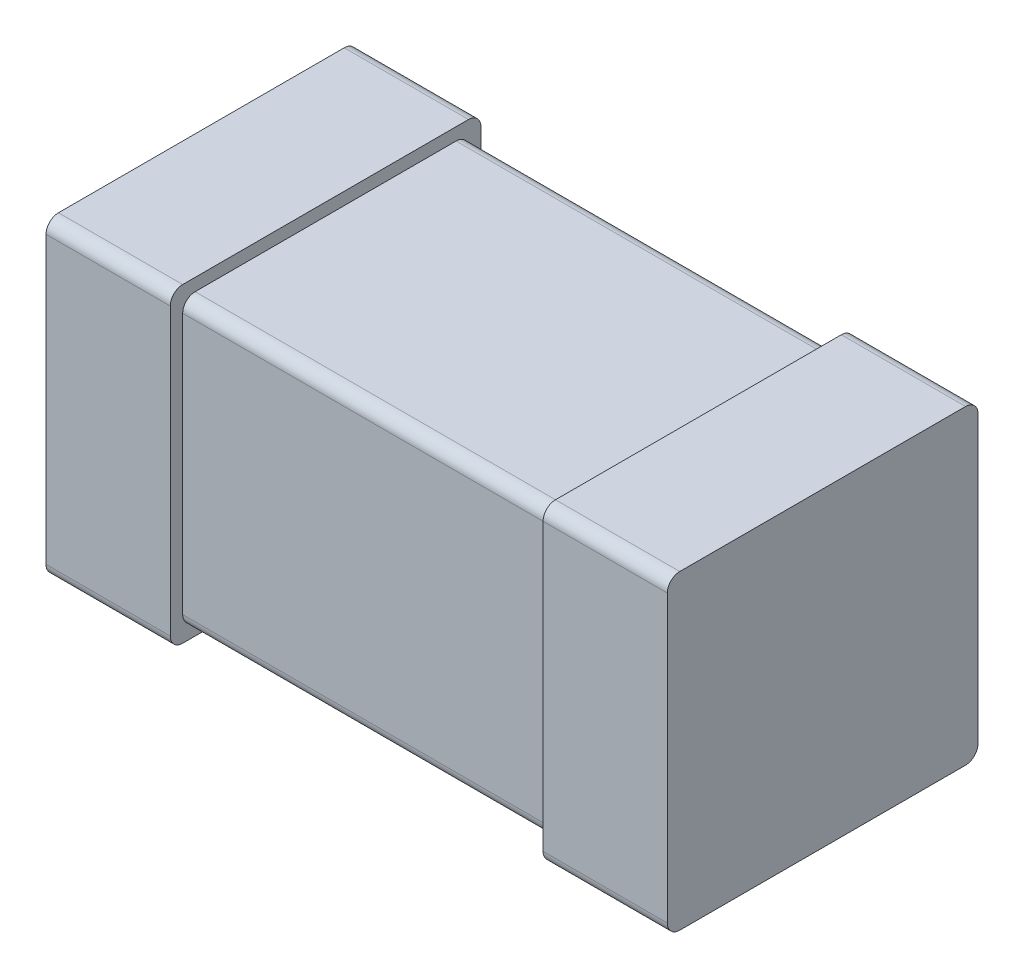
ISO-10303-21;
HEADER;
FILE_DESCRIPTION(('STEP AP214'),'2;1');
FILE_NAME('part.step','',(''),(''),'','','');
FILE_SCHEMA(('AUTOMOTIVE_DESIGN { 1 0 10303 214 1 1 1 1 }'));
ENDSEC;
DATA;
#1=APPLICATION_CONTEXT('core data for automotive mechanical design processes');
#2=APPLICATION_PROTOCOL_DEFINITION('international standard','automotive_design',2000,#1);
#3=PRODUCT_CONTEXT('',#1,'mechanical');
#4=PRODUCT('Part','Part','',(#3));
#5=PRODUCT_RELATED_PRODUCT_CATEGORY('part','',(#4));
#6=PRODUCT_DEFINITION_FORMATION('','',#4);
#7=PRODUCT_DEFINITION_CONTEXT('part definition',#1,'design');
#8=PRODUCT_DEFINITION('design','',#6,#7);
#9=PRODUCT_DEFINITION_SHAPE('','',#8);
#10=(LENGTH_UNIT() NAMED_UNIT(*) SI_UNIT(.MILLI.,.METRE.));
#11=(NAMED_UNIT(*) PLANE_ANGLE_UNIT() SI_UNIT($,.RADIAN.));
#12=(NAMED_UNIT(*) SI_UNIT($,.STERADIAN.) SOLID_ANGLE_UNIT());
#13=UNCERTAINTY_MEASURE_WITH_UNIT(LENGTH_MEASURE(1.E-05),#10,'distance_accuracy_value','');
#14=(GEOMETRIC_REPRESENTATION_CONTEXT(3) GLOBAL_UNCERTAINTY_ASSIGNED_CONTEXT((#13)) GLOBAL_UNIT_ASSIGNED_CONTEXT((#10,
#11,#12)) REPRESENTATION_CONTEXT('',''));
#15=CARTESIAN_POINT('',(0.,0.,0.));
#16=DIRECTION('',(0.,0.,1.));
#17=DIRECTION('',(1.,0.,0.));
#18=AXIS2_PLACEMENT_3D('',#15,#16,#17);
#19=CARTESIAN_POINT('',(0.5,-0.25,0.));
#20=DIRECTION('',(1.,0.,0.));
#21=DIRECTION('',(0.,1.,0.));
#22=AXIS2_PLACEMENT_3D('',#19,#20,#21);
#23=PLANE('',#22);
#24=DIRECTION('',(0.,0.,1.));
#25=VECTOR('',#24,1.);
#26=CARTESIAN_POINT('',(0.5,-0.25,0.));
#27=LINE('',#26,#25);
#28=CARTESIAN_POINT('',(0.5,-0.25,0.02));
#29=VERTEX_POINT('',#28);
#30=CARTESIAN_POINT('',(0.5,-0.25,0.48));
#31=VERTEX_POINT('',#30);
#32=EDGE_CURVE('E409',#29,#31,#27,.T.);
#33=ORIENTED_EDGE('',*,*,#32,.F.);
#34=CARTESIAN_POINT('',(0.5,-0.23,0.02));
#35=DIRECTION('',(1.,0.,0.));
#36=DIRECTION('',(0.,0.,1.));
#37=AXIS2_PLACEMENT_3D('',#34,#35,#36);
#38=CIRCLE('',#37,0.02);
#39=CARTESIAN_POINT('',(0.5,-0.23,0.));
#40=VERTEX_POINT('',#39);
#41=EDGE_CURVE('E286',#29,#40,#38,.T.);
#42=ORIENTED_EDGE('',*,*,#41,.T.);
#43=DIRECTION('',(0.,1.,0.));
#44=VECTOR('',#43,1.);
#45=CARTESIAN_POINT('',(0.5,-0.25,0.));
#46=LINE('',#45,#44);
#47=CARTESIAN_POINT('',(0.5,0.23,0.));
#48=VERTEX_POINT('',#47);
#49=EDGE_CURVE('E301',#40,#48,#46,.T.);
#50=ORIENTED_EDGE('',*,*,#49,.T.);
#51=CARTESIAN_POINT('',(0.5,0.23,0.02));
#52=DIRECTION('',(-1.,0.,0.));
#53=DIRECTION('',(0.,0.,1.));
#54=AXIS2_PLACEMENT_3D('',#51,#52,#53);
#55=CIRCLE('',#54,0.02);
#56=CARTESIAN_POINT('',(0.5,0.25,0.02));
#57=VERTEX_POINT('',#56);
#58=EDGE_CURVE('E423',#57,#48,#55,.T.);
#59=ORIENTED_EDGE('',*,*,#58,.F.);
#60=DIRECTION('',(0.,0.,1.));
#61=VECTOR('',#60,1.);
#62=CARTESIAN_POINT('',(0.5,0.25,0.));
#63=LINE('',#62,#61);
#64=CARTESIAN_POINT('',(0.5,0.25,0.48));
#65=VERTEX_POINT('',#64);
#66=EDGE_CURVE('E11',#57,#65,#63,.T.);
#67=ORIENTED_EDGE('',*,*,#66,.T.);
#68=CARTESIAN_POINT('',(0.5,0.23,0.48));
#69=DIRECTION('',(1.,0.,0.));
#70=DIRECTION('',(0.,0.,1.));
#71=AXIS2_PLACEMENT_3D('',#68,#69,#70);
#72=CIRCLE('',#71,0.02);
#73=CARTESIAN_POINT('',(0.5,0.23,0.5));
#74=VERTEX_POINT('',#73);
#75=EDGE_CURVE('E21',#65,#74,#72,.T.);
#76=ORIENTED_EDGE('',*,*,#75,.T.);
#77=DIRECTION('',(0.,1.,0.));
#78=VECTOR('',#77,1.);
#79=CARTESIAN_POINT('',(0.5,-0.25,0.5));
#80=LINE('',#79,#78);
#81=CARTESIAN_POINT('',(0.5,-0.23,0.5));
#82=VERTEX_POINT('',#81);
#83=EDGE_CURVE('E332',#82,#74,#80,.T.);
#84=ORIENTED_EDGE('',*,*,#83,.F.);
#85=CARTESIAN_POINT('',(0.5,-0.23,0.48));
#86=DIRECTION('',(-1.,0.,0.));
#87=DIRECTION('',(0.,0.,1.));
#88=AXIS2_PLACEMENT_3D('',#85,#86,#87);
#89=CIRCLE('',#88,0.02);
#90=EDGE_CURVE('E281',#31,#82,#89,.T.);
#91=ORIENTED_EDGE('',*,*,#90,.F.);
#92=EDGE_LOOP('',(#33,#42,#50,#59,#67,#76,#84,#91));
#93=FACE_BOUND('',#92,.T.);
#94=ADVANCED_FACE('F18',(#93),#23,.T.);
#95=CARTESIAN_POINT('',(0.3,0.25,0.));
#96=DIRECTION('',(0.,1.,0.));
#97=DIRECTION('',(1.,0.,0.));
#98=AXIS2_PLACEMENT_3D('',#95,#96,#97);
#99=PLANE('',#98);
#100=ORIENTED_EDGE('',*,*,#66,.F.);
#101=DIRECTION('',(1.,0.,0.));
#102=VECTOR('',#101,1.);
#103=CARTESIAN_POINT('',(0.3,0.25,0.02));
#104=LINE('',#103,#102);
#105=CARTESIAN_POINT('',(0.3,0.25,0.02));
#106=VERTEX_POINT('',#105);
#107=EDGE_CURVE('E420',#106,#57,#104,.T.);
#108=ORIENTED_EDGE('',*,*,#107,.F.);
#109=DIRECTION('',(0.,0.,1.));
#110=VECTOR('',#109,1.);
#111=CARTESIAN_POINT('',(0.3,0.25,0.));
#112=LINE('',#111,#110);
#113=CARTESIAN_POINT('',(0.3,0.25,0.48));
#114=VERTEX_POINT('',#113);
#115=EDGE_CURVE('E381',#106,#114,#112,.T.);
#116=ORIENTED_EDGE('',*,*,#115,.T.);
#117=DIRECTION('',(1.,0.,0.));
#118=VECTOR('',#117,1.);
#119=CARTESIAN_POINT('',(0.3,0.25,0.48));
#120=LINE('',#119,#118);
#121=EDGE_CURVE('E27',#114,#65,#120,.T.);
#122=ORIENTED_EDGE('',*,*,#121,.T.);
#123=EDGE_LOOP('',(#100,#108,#116,#122));
#124=FACE_BOUND('',#123,.T.);
#125=ADVANCED_FACE('F604',(#124),#99,.T.);
#126=CARTESIAN_POINT('',(0.3,0.23,0.48));
#127=DIRECTION('',(1.,0.,0.));
#128=DIRECTION('',(0.,1.,0.));
#129=AXIS2_PLACEMENT_3D('',#126,#127,#128);
#130=CYLINDRICAL_SURFACE('',#129,0.02);
#131=CARTESIAN_POINT('',(0.3,0.23,0.48));
#132=DIRECTION('',(1.,0.,0.));
#133=DIRECTION('',(0.,0.,1.));
#134=AXIS2_PLACEMENT_3D('',#131,#132,#133);
#135=CIRCLE('',#134,0.02);
#136=CARTESIAN_POINT('',(0.3,0.23,0.5));
#137=VERTEX_POINT('',#136);
#138=EDGE_CURVE('E380',#114,#137,#135,.T.);
#139=ORIENTED_EDGE('',*,*,#138,.T.);
#140=DIRECTION('',(1.,0.,0.));
#141=VECTOR('',#140,1.);
#142=CARTESIAN_POINT('',(0.3,0.23,0.5));
#143=LINE('',#142,#141);
#144=EDGE_CURVE('E336',#137,#74,#143,.T.);
#145=ORIENTED_EDGE('',*,*,#144,.T.);
#146=ORIENTED_EDGE('',*,*,#75,.F.);
#147=ORIENTED_EDGE('',*,*,#121,.F.);
#148=EDGE_LOOP('',(#139,#145,#146,#147));
#149=FACE_BOUND('',#148,.T.);
#150=ADVANCED_FACE('F434',(#149),#130,.T.);
#151=CARTESIAN_POINT('',(0.3,0.23,0.02));
#152=DIRECTION('',(1.,0.,0.));
#153=DIRECTION('',(0.,1.,0.));
#154=AXIS2_PLACEMENT_3D('',#151,#152,#153);
#155=CYLINDRICAL_SURFACE('',#154,0.02);
#156=ORIENTED_EDGE('',*,*,#107,.T.);
#157=ORIENTED_EDGE('',*,*,#58,.T.);
#158=DIRECTION('',(1.,0.,0.));
#159=VECTOR('',#158,1.);
#160=CARTESIAN_POINT('',(0.3,0.23,0.));
#161=LINE('',#160,#159);
#162=CARTESIAN_POINT('',(0.3,0.23,0.));
#163=VERTEX_POINT('',#162);
#164=EDGE_CURVE('E297',#163,#48,#161,.T.);
#165=ORIENTED_EDGE('',*,*,#164,.F.);
#166=CARTESIAN_POINT('',(0.3,0.23,0.02));
#167=DIRECTION('',(-1.,0.,0.));
#168=DIRECTION('',(0.,0.,1.));
#169=AXIS2_PLACEMENT_3D('',#166,#167,#168);
#170=CIRCLE('',#169,0.02);
#171=EDGE_CURVE('E385',#106,#163,#170,.T.);
#172=ORIENTED_EDGE('',*,*,#171,.F.);
#173=EDGE_LOOP('',(#156,#157,#165,#172));
#174=FACE_BOUND('',#173,.T.);
#175=ADVANCED_FACE('F611',(#174),#155,.T.);
#176=CARTESIAN_POINT('',(0.3,-0.25,0.5));
#177=DIRECTION('',(0.,0.,1.));
#178=DIRECTION('',(1.,0.,0.));
#179=AXIS2_PLACEMENT_3D('',#176,#177,#178);
#180=PLANE('',#179);
#181=DIRECTION('',(0.,1.,0.));
#182=VECTOR('',#181,1.);
#183=CARTESIAN_POINT('',(0.3,-0.25,0.5));
#184=LINE('',#183,#182);
#185=CARTESIAN_POINT('',(0.3,-0.23,0.5));
#186=VERTEX_POINT('',#185);
#187=EDGE_CURVE('E270',#186,#137,#184,.T.);
#188=ORIENTED_EDGE('',*,*,#187,.F.);
#189=DIRECTION('',(1.,0.,0.));
#190=VECTOR('',#189,1.);
#191=CARTESIAN_POINT('',(0.3,-0.23,0.5));
#192=LINE('',#191,#190);
#193=EDGE_CURVE('E285',#186,#82,#192,.T.);
#194=ORIENTED_EDGE('',*,*,#193,.T.);
#195=ORIENTED_EDGE('',*,*,#83,.T.);
#196=ORIENTED_EDGE('',*,*,#144,.F.);
#197=EDGE_LOOP('',(#188,#194,#195,#196));
#198=FACE_BOUND('',#197,.T.);
#199=ADVANCED_FACE('F438',(#198),#180,.T.);
#200=CARTESIAN_POINT('',(0.3,-0.25,0.));
#201=DIRECTION('',(0.,0.,1.));
#202=DIRECTION('',(1.,0.,0.));
#203=AXIS2_PLACEMENT_3D('',#200,#201,#202);
#204=PLANE('',#203);
#205=ORIENTED_EDGE('',*,*,#164,.T.);
#206=ORIENTED_EDGE('',*,*,#49,.F.);
#207=DIRECTION('',(1.,0.,0.));
#208=VECTOR('',#207,1.);
#209=CARTESIAN_POINT('',(0.3,-0.23,0.));
#210=LINE('',#209,#208);
#211=CARTESIAN_POINT('',(0.3,-0.23,0.));
#212=VERTEX_POINT('',#211);
#213=EDGE_CURVE('E413',#212,#40,#210,.T.);
#214=ORIENTED_EDGE('',*,*,#213,.F.);
#215=DIRECTION('',(0.,1.,0.));
#216=VECTOR('',#215,1.);
#217=CARTESIAN_POINT('',(0.3,-0.25,0.));
#218=LINE('',#217,#216);
#219=EDGE_CURVE('E389',#212,#163,#218,.T.);
#220=ORIENTED_EDGE('',*,*,#219,.T.);
#221=EDGE_LOOP('',(#205,#206,#214,#220));
#222=FACE_BOUND('',#221,.T.);
#223=ADVANCED_FACE('F618',(#222),#204,.F.);
#224=CARTESIAN_POINT('',(0.3,-0.23,0.48));
#225=DIRECTION('',(1.,0.,0.));
#226=DIRECTION('',(0.,-1.,0.));
#227=AXIS2_PLACEMENT_3D('',#224,#225,#226);
#228=CYLINDRICAL_SURFACE('',#227,0.02);
#229=DIRECTION('',(1.,0.,0.));
#230=VECTOR('',#229,1.);
#231=CARTESIAN_POINT('',(0.3,-0.25,0.48));
#232=LINE('',#231,#230);
#233=CARTESIAN_POINT('',(0.3,-0.25,0.48));
#234=VERTEX_POINT('',#233);
#235=EDGE_CURVE('E401',#234,#31,#232,.T.);
#236=ORIENTED_EDGE('',*,*,#235,.T.);
#237=ORIENTED_EDGE('',*,*,#90,.T.);
#238=ORIENTED_EDGE('',*,*,#193,.F.);
#239=CARTESIAN_POINT('',(0.3,-0.23,0.48));
#240=DIRECTION('',(-1.,0.,0.));
#241=DIRECTION('',(0.,0.,1.));
#242=AXIS2_PLACEMENT_3D('',#239,#240,#241);
#243=CIRCLE('',#242,0.02);
#244=EDGE_CURVE('E268',#234,#186,#243,.T.);
#245=ORIENTED_EDGE('',*,*,#244,.F.);
#246=EDGE_LOOP('',(#236,#237,#238,#245));
#247=FACE_BOUND('',#246,.T.);
#248=ADVANCED_FACE('F441',(#247),#228,.T.);
#249=CARTESIAN_POINT('',(0.3,-0.23,0.02));
#250=DIRECTION('',(1.,0.,0.));
#251=DIRECTION('',(0.,-1.,0.));
#252=AXIS2_PLACEMENT_3D('',#249,#250,#251);
#253=CYLINDRICAL_SURFACE('',#252,0.02);
#254=CARTESIAN_POINT('',(0.3,-0.23,0.02));
#255=DIRECTION('',(1.,0.,0.));
#256=DIRECTION('',(0.,0.,1.));
#257=AXIS2_PLACEMENT_3D('',#254,#255,#256);
#258=CIRCLE('',#257,0.02);
#259=CARTESIAN_POINT('',(0.3,-0.25,0.02));
#260=VERTEX_POINT('',#259);
#261=EDGE_CURVE('E393',#260,#212,#258,.T.);
#262=ORIENTED_EDGE('',*,*,#261,.T.);
#263=ORIENTED_EDGE('',*,*,#213,.T.);
#264=ORIENTED_EDGE('',*,*,#41,.F.);
#265=DIRECTION('',(1.,0.,0.));
#266=VECTOR('',#265,1.);
#267=CARTESIAN_POINT('',(0.3,-0.25,0.02));
#268=LINE('',#267,#266);
#269=EDGE_CURVE('E405',#260,#29,#268,.T.);
#270=ORIENTED_EDGE('',*,*,#269,.F.);
#271=EDGE_LOOP('',(#262,#263,#264,#270));
#272=FACE_BOUND('',#271,.T.);
#273=ADVANCED_FACE('F448',(#272),#253,.T.);
#274=CARTESIAN_POINT('',(0.3,-0.25,0.));
#275=DIRECTION('',(0.,1.,0.));
#276=DIRECTION('',(1.,0.,0.));
#277=AXIS2_PLACEMENT_3D('',#274,#275,#276);
#278=PLANE('',#277);
#279=ORIENTED_EDGE('',*,*,#235,.F.);
#280=DIRECTION('',(0.,0.,1.));
#281=VECTOR('',#280,1.);
#282=CARTESIAN_POINT('',(0.3,-0.25,0.));
#283=LINE('',#282,#281);
#284=EDGE_CURVE('E397',#260,#234,#283,.T.);
#285=ORIENTED_EDGE('',*,*,#284,.F.);
#286=ORIENTED_EDGE('',*,*,#269,.T.);
#287=ORIENTED_EDGE('',*,*,#32,.T.);
#288=EDGE_LOOP('',(#279,#285,#286,#287));
#289=FACE_BOUND('',#288,.T.);
#290=ADVANCED_FACE('F444',(#289),#278,.F.);
#291=CARTESIAN_POINT('',(0.3,-0.25,0.));
#292=DIRECTION('',(1.,0.,0.));
#293=DIRECTION('',(0.,1.,0.));
#294=AXIS2_PLACEMENT_3D('',#291,#292,#293);
#295=PLANE('',#294);
#296=DIRECTION('',(0.,1.,0.));
#297=VECTOR('',#296,1.);
#298=CARTESIAN_POINT('',(0.3,-0.23,0.02));
#299=LINE('',#298,#297);
#300=CARTESIAN_POINT('',(0.3,-0.21,0.02));
#301=VERTEX_POINT('',#300);
#302=CARTESIAN_POINT('',(0.3,0.21,0.02));
#303=VERTEX_POINT('',#302);
#304=EDGE_CURVE('E341',#301,#303,#299,.T.);
#305=ORIENTED_EDGE('',*,*,#304,.T.);
#306=CARTESIAN_POINT('',(0.3,0.21,0.04));
#307=DIRECTION('',(-1.,0.,0.));
#308=DIRECTION('',(0.,0.,1.));
#309=AXIS2_PLACEMENT_3D('',#306,#307,#308);
#310=CIRCLE('',#309,0.02);
#311=CARTESIAN_POINT('',(0.3,0.23,0.04));
#312=VERTEX_POINT('',#311);
#313=EDGE_CURVE('E314',#312,#303,#310,.T.);
#314=ORIENTED_EDGE('',*,*,#313,.F.);
#315=DIRECTION('',(0.,0.,1.));
#316=VECTOR('',#315,1.);
#317=CARTESIAN_POINT('',(0.3,0.23,0.02));
#318=LINE('',#317,#316);
#319=CARTESIAN_POINT('',(0.3,0.23,0.46));
#320=VERTEX_POINT('',#319);
#321=EDGE_CURVE('E310',#312,#320,#318,.T.);
#322=ORIENTED_EDGE('',*,*,#321,.T.);
#323=CARTESIAN_POINT('',(0.3,0.21,0.46));
#324=DIRECTION('',(1.,0.,0.));
#325=DIRECTION('',(0.,0.,1.));
#326=AXIS2_PLACEMENT_3D('',#323,#324,#325);
#327=CIRCLE('',#326,0.02);
#328=CARTESIAN_POINT('',(0.3,0.21,0.48));
#329=VERTEX_POINT('',#328);
#330=EDGE_CURVE('E291',#320,#329,#327,.T.);
#331=ORIENTED_EDGE('',*,*,#330,.T.);
#332=DIRECTION('',(0.,1.,0.));
#333=VECTOR('',#332,1.);
#334=CARTESIAN_POINT('',(0.3,-0.23,0.48));
#335=LINE('',#334,#333);
#336=CARTESIAN_POINT('',(0.3,-0.21,0.48));
#337=VERTEX_POINT('',#336);
#338=EDGE_CURVE('E278',#337,#329,#335,.T.);
#339=ORIENTED_EDGE('',*,*,#338,.F.);
#340=CARTESIAN_POINT('',(0.3,-0.21,0.46));
#341=DIRECTION('',(-1.,0.,0.));
#342=DIRECTION('',(0.,0.,1.));
#343=AXIS2_PLACEMENT_3D('',#340,#341,#342);
#344=CIRCLE('',#343,0.02);
#345=CARTESIAN_POINT('',(0.3,-0.23,0.46));
#346=VERTEX_POINT('',#345);
#347=EDGE_CURVE('E277',#346,#337,#344,.T.);
#348=ORIENTED_EDGE('',*,*,#347,.F.);
#349=DIRECTION('',(0.,0.,1.));
#350=VECTOR('',#349,1.);
#351=CARTESIAN_POINT('',(0.3,-0.23,0.02));
#352=LINE('',#351,#350);
#353=CARTESIAN_POINT('',(0.3,-0.23,0.04));
#354=VERTEX_POINT('',#353);
#355=EDGE_CURVE('E271',#354,#346,#352,.T.);
#356=ORIENTED_EDGE('',*,*,#355,.F.);
#357=CARTESIAN_POINT('',(0.3,-0.21,0.04));
#358=DIRECTION('',(1.,0.,0.));
#359=DIRECTION('',(0.,0.,1.));
#360=AXIS2_PLACEMENT_3D('',#357,#358,#359);
#361=CIRCLE('',#360,0.02);
#362=EDGE_CURVE('E345',#354,#301,#361,.T.);
#363=ORIENTED_EDGE('',*,*,#362,.T.);
#364=EDGE_LOOP('',(#305,#314,#322,#331,#339,#348,#356,#363));
#365=FACE_BOUND('',#364,.T.);
#366=ORIENTED_EDGE('',*,*,#244,.T.);
#367=ORIENTED_EDGE('',*,*,#187,.T.);
#368=ORIENTED_EDGE('',*,*,#138,.F.);
#369=ORIENTED_EDGE('',*,*,#115,.F.);
#370=ORIENTED_EDGE('',*,*,#171,.T.);
#371=ORIENTED_EDGE('',*,*,#219,.F.);
#372=ORIENTED_EDGE('',*,*,#261,.F.);
#373=ORIENTED_EDGE('',*,*,#284,.T.);
#374=EDGE_LOOP('',(#366,#367,#368,#369,#370,#371,#372,#373));
#375=FACE_BOUND('',#374,.T.);
#376=ADVANCED_FACE('F505',(#365,#375),#295,.F.);
#377=CARTESIAN_POINT('',(-0.3,-0.23,0.02));
#378=DIRECTION('',(0.,1.,0.));
#379=DIRECTION('',(1.,0.,0.));
#380=AXIS2_PLACEMENT_3D('',#377,#378,#379);
#381=PLANE('',#380);
#382=DIRECTION('',(1.,0.,0.));
#383=VECTOR('',#382,1.);
#384=CARTESIAN_POINT('',(-0.3,-0.23,0.46));
#385=LINE('',#384,#383);
#386=CARTESIAN_POINT('',(-0.3,-0.23,0.46));
#387=VERTEX_POINT('',#386);
#388=EDGE_CURVE('E273',#387,#346,#385,.T.);
#389=ORIENTED_EDGE('',*,*,#388,.F.);
#390=DIRECTION('',(0.,0.,1.));
#391=VECTOR('',#390,1.);
#392=CARTESIAN_POINT('',(-0.3,-0.23,0.02));
#393=LINE('',#392,#391);
#394=CARTESIAN_POINT('',(-0.3,-0.23,0.04));
#395=VERTEX_POINT('',#394);
#396=EDGE_CURVE('E296',#395,#387,#393,.T.);
#397=ORIENTED_EDGE('',*,*,#396,.F.);
#398=DIRECTION('',(1.,0.,0.));
#399=VECTOR('',#398,1.);
#400=CARTESIAN_POINT('',(-0.3,-0.23,0.04));
#401=LINE('',#400,#399);
#402=EDGE_CURVE('E346',#395,#354,#401,.T.);
#403=ORIENTED_EDGE('',*,*,#402,.T.);
#404=ORIENTED_EDGE('',*,*,#355,.T.);
#405=EDGE_LOOP('',(#389,#397,#403,#404));
#406=FACE_BOUND('',#405,.T.);
#407=ADVANCED_FACE('F522',(#406),#381,.F.);
#408=CARTESIAN_POINT('',(-0.3,-0.21,0.46));
#409=DIRECTION('',(1.,0.,0.));
#410=DIRECTION('',(0.,-1.,0.));
#411=AXIS2_PLACEMENT_3D('',#408,#409,#410);
#412=CYLINDRICAL_SURFACE('',#411,0.02);
#413=ORIENTED_EDGE('',*,*,#388,.T.);
#414=ORIENTED_EDGE('',*,*,#347,.T.);
#415=DIRECTION('',(1.,0.,0.));
#416=VECTOR('',#415,1.);
#417=CARTESIAN_POINT('',(-0.3,-0.21,0.48));
#418=LINE('',#417,#416);
#419=CARTESIAN_POINT('',(-0.3,-0.21,0.48));
#420=VERTEX_POINT('',#419);
#421=EDGE_CURVE('E370',#420,#337,#418,.T.);
#422=ORIENTED_EDGE('',*,*,#421,.F.);
#423=CARTESIAN_POINT('',(-0.3,-0.21,0.46));
#424=DIRECTION('',(-1.,0.,0.));
#425=DIRECTION('',(0.,0.,1.));
#426=AXIS2_PLACEMENT_3D('',#423,#424,#425);
#427=CIRCLE('',#426,0.02);
#428=EDGE_CURVE('E305',#387,#420,#427,.T.);
#429=ORIENTED_EDGE('',*,*,#428,.F.);
#430=EDGE_LOOP('',(#413,#414,#422,#429));
#431=FACE_BOUND('',#430,.T.);
#432=ADVANCED_FACE('F524',(#431),#412,.T.);
#433=CARTESIAN_POINT('',(-0.3,-0.23,0.48));
#434=DIRECTION('',(0.,0.,1.));
#435=DIRECTION('',(1.,0.,0.));
#436=AXIS2_PLACEMENT_3D('',#433,#434,#435);
#437=PLANE('',#436);
#438=DIRECTION('',(0.,1.,0.));
#439=VECTOR('',#438,1.);
#440=CARTESIAN_POINT('',(-0.3,-0.23,0.48));
#441=LINE('',#440,#439);
#442=CARTESIAN_POINT('',(-0.3,0.21,0.48));
#443=VERTEX_POINT('',#442);
#444=EDGE_CURVE('E309',#420,#443,#441,.T.);
#445=ORIENTED_EDGE('',*,*,#444,.F.);
#446=ORIENTED_EDGE('',*,*,#421,.T.);
#447=ORIENTED_EDGE('',*,*,#338,.T.);
#448=DIRECTION('',(1.,0.,0.));
#449=VECTOR('',#448,1.);
#450=CARTESIAN_POINT('',(-0.3,0.21,0.48));
#451=LINE('',#450,#449);
#452=EDGE_CURVE('E287',#443,#329,#451,.T.);
#453=ORIENTED_EDGE('',*,*,#452,.F.);
#454=EDGE_LOOP('',(#445,#446,#447,#453));
#455=FACE_BOUND('',#454,.T.);
#456=ADVANCED_FACE('F500',(#455),#437,.T.);
#457=CARTESIAN_POINT('',(-0.3,0.21,0.46));
#458=DIRECTION('',(1.,0.,0.));
#459=DIRECTION('',(0.,1.,0.));
#460=AXIS2_PLACEMENT_3D('',#457,#458,#459);
#461=CYLINDRICAL_SURFACE('',#460,0.02);
#462=CARTESIAN_POINT('',(-0.3,0.21,0.46));
#463=DIRECTION('',(1.,0.,0.));
#464=DIRECTION('',(0.,0.,1.));
#465=AXIS2_PLACEMENT_3D('',#462,#463,#464);
#466=CIRCLE('',#465,0.02);
#467=CARTESIAN_POINT('',(-0.3,0.23,0.46));
#468=VERTEX_POINT('',#467);
#469=EDGE_CURVE('E318',#468,#443,#466,.T.);
#470=ORIENTED_EDGE('',*,*,#469,.T.);
#471=ORIENTED_EDGE('',*,*,#452,.T.);
#472=ORIENTED_EDGE('',*,*,#330,.F.);
#473=DIRECTION('',(1.,0.,0.));
#474=VECTOR('',#473,1.);
#475=CARTESIAN_POINT('',(-0.3,0.23,0.46));
#476=LINE('',#475,#474);
#477=EDGE_CURVE('E292',#468,#320,#476,.T.);
#478=ORIENTED_EDGE('',*,*,#477,.F.);
#479=EDGE_LOOP('',(#470,#471,#472,#478));
#480=FACE_BOUND('',#479,.T.);
#481=ADVANCED_FACE('F492',(#480),#461,.T.);
#482=CARTESIAN_POINT('',(-0.3,0.23,0.02));
#483=DIRECTION('',(0.,1.,0.));
#484=DIRECTION('',(1.,0.,0.));
#485=AXIS2_PLACEMENT_3D('',#482,#483,#484);
#486=PLANE('',#485);
#487=ORIENTED_EDGE('',*,*,#321,.F.);
#488=DIRECTION('',(1.,0.,0.));
#489=VECTOR('',#488,1.);
#490=CARTESIAN_POINT('',(-0.3,0.23,0.04));
#491=LINE('',#490,#489);
#492=CARTESIAN_POINT('',(-0.3,0.23,0.04));
#493=VERTEX_POINT('',#492);
#494=EDGE_CURVE('E337',#493,#312,#491,.T.);
#495=ORIENTED_EDGE('',*,*,#494,.F.);
#496=DIRECTION('',(0.,0.,1.));
#497=VECTOR('',#496,1.);
#498=CARTESIAN_POINT('',(-0.3,0.23,0.02));
#499=LINE('',#498,#497);
#500=EDGE_CURVE('E319',#493,#468,#499,.T.);
#501=ORIENTED_EDGE('',*,*,#500,.T.);
#502=ORIENTED_EDGE('',*,*,#477,.T.);
#503=EDGE_LOOP('',(#487,#495,#501,#502));
#504=FACE_BOUND('',#503,.T.);
#505=ADVANCED_FACE('F509',(#504),#486,.T.);
#506=CARTESIAN_POINT('',(-0.3,0.21,0.04));
#507=DIRECTION('',(1.,0.,0.));
#508=DIRECTION('',(0.,1.,0.));
#509=AXIS2_PLACEMENT_3D('',#506,#507,#508);
#510=CYLINDRICAL_SURFACE('',#509,0.02);
#511=ORIENTED_EDGE('',*,*,#494,.T.);
#512=ORIENTED_EDGE('',*,*,#313,.T.);
#513=DIRECTION('',(1.,0.,0.));
#514=VECTOR('',#513,1.);
#515=CARTESIAN_POINT('',(-0.3,0.21,0.02));
#516=LINE('',#515,#514);
#517=CARTESIAN_POINT('',(-0.3,0.21,0.02));
#518=VERTEX_POINT('',#517);
#519=EDGE_CURVE('E350',#518,#303,#516,.T.);
#520=ORIENTED_EDGE('',*,*,#519,.F.);
#521=CARTESIAN_POINT('',(-0.3,0.21,0.04));
#522=DIRECTION('',(-1.,0.,0.));
#523=DIRECTION('',(0.,0.,1.));
#524=AXIS2_PLACEMENT_3D('',#521,#522,#523);
#525=CIRCLE('',#524,0.02);
#526=EDGE_CURVE('E323',#493,#518,#525,.T.);
#527=ORIENTED_EDGE('',*,*,#526,.F.);
#528=EDGE_LOOP('',(#511,#512,#520,#527));
#529=FACE_BOUND('',#528,.T.);
#530=ADVANCED_FACE('F513',(#529),#510,.T.);
#531=CARTESIAN_POINT('',(-0.3,-0.23,0.02));
#532=DIRECTION('',(0.,0.,1.));
#533=DIRECTION('',(1.,0.,0.));
#534=AXIS2_PLACEMENT_3D('',#531,#532,#533);
#535=PLANE('',#534);
#536=ORIENTED_EDGE('',*,*,#519,.T.);
#537=ORIENTED_EDGE('',*,*,#304,.F.);
#538=DIRECTION('',(1.,0.,0.));
#539=VECTOR('',#538,1.);
#540=CARTESIAN_POINT('',(-0.3,-0.21,0.02));
#541=LINE('',#540,#539);
#542=CARTESIAN_POINT('',(-0.3,-0.21,0.02));
#543=VERTEX_POINT('',#542);
#544=EDGE_CURVE('E331',#543,#301,#541,.T.);
#545=ORIENTED_EDGE('',*,*,#544,.F.);
#546=DIRECTION('',(0.,1.,0.));
#547=VECTOR('',#546,1.);
#548=CARTESIAN_POINT('',(-0.3,-0.23,0.02));
#549=LINE('',#548,#547);
#550=EDGE_CURVE('E327',#543,#518,#549,.T.);
#551=ORIENTED_EDGE('',*,*,#550,.T.);
#552=EDGE_LOOP('',(#536,#537,#545,#551));
#553=FACE_BOUND('',#552,.T.);
#554=ADVANCED_FACE('F515',(#553),#535,.F.);
#555=CARTESIAN_POINT('',(-0.3,-0.21,0.04));
#556=DIRECTION('',(1.,0.,0.));
#557=DIRECTION('',(0.,-1.,0.));
#558=AXIS2_PLACEMENT_3D('',#555,#556,#557);
#559=CYLINDRICAL_SURFACE('',#558,0.02);
#560=CARTESIAN_POINT('',(-0.3,-0.21,0.04));
#561=DIRECTION('',(1.,0.,0.));
#562=DIRECTION('',(0.,0.,1.));
#563=AXIS2_PLACEMENT_3D('',#560,#561,#562);
#564=CIRCLE('',#563,0.02);
#565=EDGE_CURVE('E240',#395,#543,#564,.T.);
#566=ORIENTED_EDGE('',*,*,#565,.T.);
#567=ORIENTED_EDGE('',*,*,#544,.T.);
#568=ORIENTED_EDGE('',*,*,#362,.F.);
#569=ORIENTED_EDGE('',*,*,#402,.F.);
#570=EDGE_LOOP('',(#566,#567,#568,#569));
#571=FACE_BOUND('',#570,.T.);
#572=ADVANCED_FACE('F519',(#571),#559,.T.);
#573=CARTESIAN_POINT('',(-0.3,-0.25,0.));
#574=DIRECTION('',(1.,0.,0.));
#575=DIRECTION('',(0.,1.,0.));
#576=AXIS2_PLACEMENT_3D('',#573,#574,#575);
#577=PLANE('',#576);
#578=ORIENTED_EDGE('',*,*,#565,.F.);
#579=ORIENTED_EDGE('',*,*,#396,.T.);
#580=ORIENTED_EDGE('',*,*,#428,.T.);
#581=ORIENTED_EDGE('',*,*,#444,.T.);
#582=ORIENTED_EDGE('',*,*,#469,.F.);
#583=ORIENTED_EDGE('',*,*,#500,.F.);
#584=ORIENTED_EDGE('',*,*,#526,.T.);
#585=ORIENTED_EDGE('',*,*,#550,.F.);
#586=EDGE_LOOP('',(#578,#579,#580,#581,#582,#583,#584,#585));
#587=FACE_BOUND('',#586,.T.);
#588=DIRECTION('',(0.,0.,1.));
#589=VECTOR('',#588,1.);
#590=CARTESIAN_POINT('',(-0.3,-0.25,0.));
#591=LINE('',#590,#589);
#592=CARTESIAN_POINT('',(-0.3,-0.25,0.02));
#593=VERTEX_POINT('',#592);
#594=CARTESIAN_POINT('',(-0.3,-0.25,0.48));
#595=VERTEX_POINT('',#594);
#596=EDGE_CURVE('E480',#593,#595,#591,.T.);
#597=ORIENTED_EDGE('',*,*,#596,.F.);
#598=CARTESIAN_POINT('',(-0.3,-0.23,0.02));
#599=DIRECTION('',(1.,0.,0.));
#600=DIRECTION('',(0.,0.,1.));
#601=AXIS2_PLACEMENT_3D('',#598,#599,#600);
#602=CIRCLE('',#601,0.02);
#603=CARTESIAN_POINT('',(-0.3,-0.23,0.));
#604=VERTEX_POINT('',#603);
#605=EDGE_CURVE('E479',#593,#604,#602,.T.);
#606=ORIENTED_EDGE('',*,*,#605,.T.);
#607=DIRECTION('',(0.,1.,0.));
#608=VECTOR('',#607,1.);
#609=CARTESIAN_POINT('',(-0.3,-0.25,0.));
#610=LINE('',#609,#608);
#611=CARTESIAN_POINT('',(-0.3,0.23,0.));
#612=VERTEX_POINT('',#611);
#613=EDGE_CURVE('E247',#604,#612,#610,.T.);
#614=ORIENTED_EDGE('',*,*,#613,.T.);
#615=CARTESIAN_POINT('',(-0.3,0.23,0.02));
#616=DIRECTION('',(-1.,0.,0.));
#617=DIRECTION('',(0.,0.,1.));
#618=AXIS2_PLACEMENT_3D('',#615,#616,#617);
#619=CIRCLE('',#618,0.02);
#620=CARTESIAN_POINT('',(-0.3,0.25,0.02));
#621=VERTEX_POINT('',#620);
#622=EDGE_CURVE('E243',#621,#612,#619,.T.);
#623=ORIENTED_EDGE('',*,*,#622,.F.);
#624=DIRECTION('',(0.,0.,1.));
#625=VECTOR('',#624,1.);
#626=CARTESIAN_POINT('',(-0.3,0.25,0.));
#627=LINE('',#626,#625);
#628=CARTESIAN_POINT('',(-0.3,0.25,0.48));
#629=VERTEX_POINT('',#628);
#630=EDGE_CURVE('E229',#621,#629,#627,.T.);
#631=ORIENTED_EDGE('',*,*,#630,.T.);
#632=CARTESIAN_POINT('',(-0.3,0.23,0.48));
#633=DIRECTION('',(1.,0.,0.));
#634=DIRECTION('',(0.,0.,1.));
#635=AXIS2_PLACEMENT_3D('',#632,#633,#634);
#636=CIRCLE('',#635,0.02);
#637=CARTESIAN_POINT('',(-0.3,0.23,0.5));
#638=VERTEX_POINT('',#637);
#639=EDGE_CURVE('E251',#629,#638,#636,.T.);
#640=ORIENTED_EDGE('',*,*,#639,.T.);
#641=DIRECTION('',(0.,1.,0.));
#642=VECTOR('',#641,1.);
#643=CARTESIAN_POINT('',(-0.3,-0.25,0.5));
#644=LINE('',#643,#642);
#645=CARTESIAN_POINT('',(-0.3,-0.23,0.5));
#646=VERTEX_POINT('',#645);
#647=EDGE_CURVE('E264',#646,#638,#644,.T.);
#648=ORIENTED_EDGE('',*,*,#647,.F.);
#649=CARTESIAN_POINT('',(-0.3,-0.23,0.48));
#650=DIRECTION('',(-1.,0.,0.));
#651=DIRECTION('',(0.,0.,1.));
#652=AXIS2_PLACEMENT_3D('',#649,#650,#651);
#653=CIRCLE('',#652,0.02);
#654=EDGE_CURVE('E471',#595,#646,#653,.T.);
#655=ORIENTED_EDGE('',*,*,#654,.F.);
#656=EDGE_LOOP('',(#597,#606,#614,#623,#631,#640,#648,#655));
#657=FACE_BOUND('',#656,.T.);
#658=ADVANCED_FACE('F245',(#587,#657),#577,.T.);
#659=CARTESIAN_POINT('',(-0.5,0.25,0.));
#660=DIRECTION('',(0.,1.,0.));
#661=DIRECTION('',(1.,0.,0.));
#662=AXIS2_PLACEMENT_3D('',#659,#660,#661);
#663=PLANE('',#662);
#664=ORIENTED_EDGE('',*,*,#630,.F.);
#665=DIRECTION('',(1.,0.,0.));
#666=VECTOR('',#665,1.);
#667=CARTESIAN_POINT('',(-0.5,0.25,0.02));
#668=LINE('',#667,#666);
#669=CARTESIAN_POINT('',(-0.5,0.25,0.02));
#670=VERTEX_POINT('',#669);
#671=EDGE_CURVE('E234',#670,#621,#668,.T.);
#672=ORIENTED_EDGE('',*,*,#671,.F.);
#673=DIRECTION('',(0.,0.,1.));
#674=VECTOR('',#673,1.);
#675=CARTESIAN_POINT('',(-0.5,0.25,0.));
#676=LINE('',#675,#674);
#677=CARTESIAN_POINT('',(-0.5,0.25,0.48));
#678=VERTEX_POINT('',#677);
#679=EDGE_CURVE('E538',#670,#678,#676,.T.);
#680=ORIENTED_EDGE('',*,*,#679,.T.);
#681=DIRECTION('',(1.,0.,0.));
#682=VECTOR('',#681,1.);
#683=CARTESIAN_POINT('',(-0.5,0.25,0.48));
#684=LINE('',#683,#682);
#685=EDGE_CURVE('E236',#678,#629,#684,.T.);
#686=ORIENTED_EDGE('',*,*,#685,.T.);
#687=EDGE_LOOP('',(#664,#672,#680,#686));
#688=FACE_BOUND('',#687,.T.);
#689=ADVANCED_FACE('F231',(#688),#663,.T.);
#690=CARTESIAN_POINT('',(-0.5,0.23,0.48));
#691=DIRECTION('',(1.,0.,0.));
#692=DIRECTION('',(0.,1.,0.));
#693=AXIS2_PLACEMENT_3D('',#690,#691,#692);
#694=CYLINDRICAL_SURFACE('',#693,0.02);
#695=CARTESIAN_POINT('',(-0.5,0.23,0.48));
#696=DIRECTION('',(1.,0.,0.));
#697=DIRECTION('',(0.,0.,1.));
#698=AXIS2_PLACEMENT_3D('',#695,#696,#697);
#699=CIRCLE('',#698,0.02);
#700=CARTESIAN_POINT('',(-0.5,0.23,0.5));
#701=VERTEX_POINT('',#700);
#702=EDGE_CURVE('E532',#678,#701,#699,.T.);
#703=ORIENTED_EDGE('',*,*,#702,.T.);
#704=DIRECTION('',(1.,0.,0.));
#705=VECTOR('',#704,1.);
#706=CARTESIAN_POINT('',(-0.5,0.23,0.5));
#707=LINE('',#706,#705);
#708=EDGE_CURVE('E258',#701,#638,#707,.T.);
#709=ORIENTED_EDGE('',*,*,#708,.T.);
#710=ORIENTED_EDGE('',*,*,#639,.F.);
#711=ORIENTED_EDGE('',*,*,#685,.F.);
#712=EDGE_LOOP('',(#703,#709,#710,#711));
#713=FACE_BOUND('',#712,.T.);
#714=ADVANCED_FACE('F586',(#713),#694,.T.);
#715=CARTESIAN_POINT('',(-0.5,0.23,0.02));
#716=DIRECTION('',(1.,0.,0.));
#717=DIRECTION('',(0.,1.,0.));
#718=AXIS2_PLACEMENT_3D('',#715,#716,#717);
#719=CYLINDRICAL_SURFACE('',#718,0.02);
#720=ORIENTED_EDGE('',*,*,#671,.T.);
#721=ORIENTED_EDGE('',*,*,#622,.T.);
#722=DIRECTION('',(1.,0.,0.));
#723=VECTOR('',#722,1.);
#724=CARTESIAN_POINT('',(-0.5,0.23,0.));
#725=LINE('',#724,#723);
#726=CARTESIAN_POINT('',(-0.5,0.23,0.));
#727=VERTEX_POINT('',#726);
#728=EDGE_CURVE('E458',#727,#612,#725,.T.);
#729=ORIENTED_EDGE('',*,*,#728,.F.);
#730=CARTESIAN_POINT('',(-0.5,0.23,0.02));
#731=DIRECTION('',(-1.,0.,0.));
#732=DIRECTION('',(0.,0.,1.));
#733=AXIS2_PLACEMENT_3D('',#730,#731,#732);
#734=CIRCLE('',#733,0.02);
#735=EDGE_CURVE('E255',#670,#727,#734,.T.);
#736=ORIENTED_EDGE('',*,*,#735,.F.);
#737=EDGE_LOOP('',(#720,#721,#729,#736));
#738=FACE_BOUND('',#737,.T.);
#739=ADVANCED_FACE('F253',(#738),#719,.T.);
#740=CARTESIAN_POINT('',(-0.5,-0.25,0.5));
#741=DIRECTION('',(0.,0.,1.));
#742=DIRECTION('',(1.,0.,0.));
#743=AXIS2_PLACEMENT_3D('',#740,#741,#742);
#744=PLANE('',#743);
#745=DIRECTION('',(0.,1.,0.));
#746=VECTOR('',#745,1.);
#747=CARTESIAN_POINT('',(-0.5,-0.25,0.5));
#748=LINE('',#747,#746);
#749=CARTESIAN_POINT('',(-0.5,-0.23,0.5));
#750=VERTEX_POINT('',#749);
#751=EDGE_CURVE('E577',#750,#701,#748,.T.);
#752=ORIENTED_EDGE('',*,*,#751,.F.);
#753=DIRECTION('',(1.,0.,0.));
#754=VECTOR('',#753,1.);
#755=CARTESIAN_POINT('',(-0.5,-0.23,0.5));
#756=LINE('',#755,#754);
#757=EDGE_CURVE('E456',#750,#646,#756,.T.);
#758=ORIENTED_EDGE('',*,*,#757,.T.);
#759=ORIENTED_EDGE('',*,*,#647,.T.);
#760=ORIENTED_EDGE('',*,*,#708,.F.);
#761=EDGE_LOOP('',(#752,#758,#759,#760));
#762=FACE_BOUND('',#761,.T.);
#763=ADVANCED_FACE('F588',(#762),#744,.T.);
#764=CARTESIAN_POINT('',(-0.5,-0.25,0.));
#765=DIRECTION('',(0.,0.,1.));
#766=DIRECTION('',(1.,0.,0.));
#767=AXIS2_PLACEMENT_3D('',#764,#765,#766);
#768=PLANE('',#767);
#769=ORIENTED_EDGE('',*,*,#728,.T.);
#770=ORIENTED_EDGE('',*,*,#613,.F.);
#771=DIRECTION('',(1.,0.,0.));
#772=VECTOR('',#771,1.);
#773=CARTESIAN_POINT('',(-0.5,-0.23,0.));
#774=LINE('',#773,#772);
#775=CARTESIAN_POINT('',(-0.5,-0.23,0.));
#776=VERTEX_POINT('',#775);
#777=EDGE_CURVE('E476',#776,#604,#774,.T.);
#778=ORIENTED_EDGE('',*,*,#777,.F.);
#779=DIRECTION('',(0.,1.,0.));
#780=VECTOR('',#779,1.);
#781=CARTESIAN_POINT('',(-0.5,-0.25,0.));
#782=LINE('',#781,#780);
#783=EDGE_CURVE('E545',#776,#727,#782,.T.);
#784=ORIENTED_EDGE('',*,*,#783,.T.);
#785=EDGE_LOOP('',(#769,#770,#778,#784));
#786=FACE_BOUND('',#785,.T.);
#787=ADVANCED_FACE('F562',(#786),#768,.F.);
#788=CARTESIAN_POINT('',(-0.5,-0.23,0.48));
#789=DIRECTION('',(1.,0.,0.));
#790=DIRECTION('',(0.,-1.,0.));
#791=AXIS2_PLACEMENT_3D('',#788,#789,#790);
#792=CYLINDRICAL_SURFACE('',#791,0.02);
#793=DIRECTION('',(1.,0.,0.));
#794=VECTOR('',#793,1.);
#795=CARTESIAN_POINT('',(-0.5,-0.25,0.48));
#796=LINE('',#795,#794);
#797=CARTESIAN_POINT('',(-0.5,-0.25,0.48));
#798=VERTEX_POINT('',#797);
#799=EDGE_CURVE('E474',#798,#595,#796,.T.);
#800=ORIENTED_EDGE('',*,*,#799,.T.);
#801=ORIENTED_EDGE('',*,*,#654,.T.);
#802=ORIENTED_EDGE('',*,*,#757,.F.);
#803=CARTESIAN_POINT('',(-0.5,-0.23,0.48));
#804=DIRECTION('',(-1.,0.,0.));
#805=DIRECTION('',(0.,0.,1.));
#806=AXIS2_PLACEMENT_3D('',#803,#804,#805);
#807=CIRCLE('',#806,0.02);
#808=EDGE_CURVE('E574',#798,#750,#807,.T.);
#809=ORIENTED_EDGE('',*,*,#808,.F.);
#810=EDGE_LOOP('',(#800,#801,#802,#809));
#811=FACE_BOUND('',#810,.T.);
#812=ADVANCED_FACE('F591',(#811),#792,.T.);
#813=CARTESIAN_POINT('',(-0.5,-0.23,0.02));
#814=DIRECTION('',(1.,0.,0.));
#815=DIRECTION('',(0.,-1.,0.));
#816=AXIS2_PLACEMENT_3D('',#813,#814,#815);
#817=CYLINDRICAL_SURFACE('',#816,0.02);
#818=CARTESIAN_POINT('',(-0.5,-0.23,0.02));
#819=DIRECTION('',(1.,0.,0.));
#820=DIRECTION('',(0.,0.,1.));
#821=AXIS2_PLACEMENT_3D('',#818,#819,#820);
#822=CIRCLE('',#821,0.02);
#823=CARTESIAN_POINT('',(-0.5,-0.25,0.02));
#824=VERTEX_POINT('',#823);
#825=EDGE_CURVE('E537',#824,#776,#822,.T.);
#826=ORIENTED_EDGE('',*,*,#825,.T.);
#827=ORIENTED_EDGE('',*,*,#777,.T.);
#828=ORIENTED_EDGE('',*,*,#605,.F.);
#829=DIRECTION('',(1.,0.,0.));
#830=VECTOR('',#829,1.);
#831=CARTESIAN_POINT('',(-0.5,-0.25,0.02));
#832=LINE('',#831,#830);
#833=EDGE_CURVE('E557',#824,#593,#832,.T.);
#834=ORIENTED_EDGE('',*,*,#833,.F.);
#835=EDGE_LOOP('',(#826,#827,#828,#834));
#836=FACE_BOUND('',#835,.T.);
#837=ADVANCED_FACE('F555',(#836),#817,.T.);
#838=CARTESIAN_POINT('',(-0.5,-0.25,0.));
#839=DIRECTION('',(0.,1.,0.));
#840=DIRECTION('',(1.,0.,0.));
#841=AXIS2_PLACEMENT_3D('',#838,#839,#840);
#842=PLANE('',#841);
#843=ORIENTED_EDGE('',*,*,#799,.F.);
#844=DIRECTION('',(0.,0.,1.));
#845=VECTOR('',#844,1.);
#846=CARTESIAN_POINT('',(-0.5,-0.25,0.));
#847=LINE('',#846,#845);
#848=EDGE_CURVE('E534',#824,#798,#847,.T.);
#849=ORIENTED_EDGE('',*,*,#848,.F.);
#850=ORIENTED_EDGE('',*,*,#833,.T.);
#851=ORIENTED_EDGE('',*,*,#596,.T.);
#852=EDGE_LOOP('',(#843,#849,#850,#851));
#853=FACE_BOUND('',#852,.T.);
#854=ADVANCED_FACE('F567',(#853),#842,.F.);
#855=CARTESIAN_POINT('',(-0.5,-0.25,0.));
#856=DIRECTION('',(1.,0.,0.));
#857=DIRECTION('',(0.,1.,0.));
#858=AXIS2_PLACEMENT_3D('',#855,#856,#857);
#859=PLANE('',#858);
#860=ORIENTED_EDGE('',*,*,#808,.T.);
#861=ORIENTED_EDGE('',*,*,#751,.T.);
#862=ORIENTED_EDGE('',*,*,#702,.F.);
#863=ORIENTED_EDGE('',*,*,#679,.F.);
#864=ORIENTED_EDGE('',*,*,#735,.T.);
#865=ORIENTED_EDGE('',*,*,#783,.F.);
#866=ORIENTED_EDGE('',*,*,#825,.F.);
#867=ORIENTED_EDGE('',*,*,#848,.T.);
#868=EDGE_LOOP('',(#860,#861,#862,#863,#864,#865,#866,#867));
#869=FACE_BOUND('',#868,.T.);
#870=ADVANCED_FACE('F561',(#869),#859,.F.);
#871=CLOSED_SHELL('',(#94,#125,#150,#175,#199,#223,#248,#273,#290,#376,#407,#432,#456,#481,#505,
#530,#554,#572,#658,#689,#714,#739,#763,#787,#812,#837,#854,#870));
#872=MANIFOLD_SOLID_BREP('B1',#871);
#873=ADVANCED_BREP_SHAPE_REPRESENTATION('',(#18,#872),#14);
#874=SHAPE_DEFINITION_REPRESENTATION(#9,#873);
ENDSEC;
END-ISO-10303-21;
